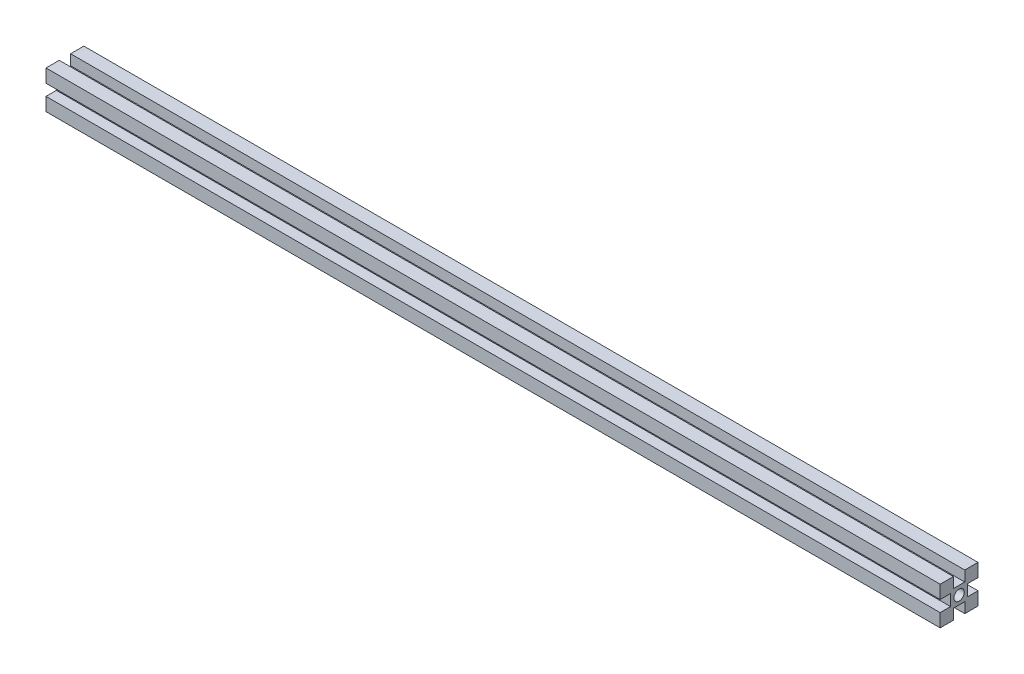
ISO-10303-21;
HEADER;
FILE_DESCRIPTION(('STEP AP214'),'2;1');
FILE_NAME('part.step','',(''),(''),'','','');
FILE_SCHEMA(('AUTOMOTIVE_DESIGN { 1 0 10303 214 1 1 1 1 }'));
ENDSEC;
DATA;
#1=APPLICATION_CONTEXT('core data for automotive mechanical design processes');
#2=APPLICATION_PROTOCOL_DEFINITION('international standard','automotive_design',2000,#1);
#3=PRODUCT_CONTEXT('',#1,'mechanical');
#4=PRODUCT('Part','Part','',(#3));
#5=PRODUCT_RELATED_PRODUCT_CATEGORY('part','',(#4));
#6=PRODUCT_DEFINITION_FORMATION('','',#4);
#7=PRODUCT_DEFINITION_CONTEXT('part definition',#1,'design');
#8=PRODUCT_DEFINITION('design','',#6,#7);
#9=PRODUCT_DEFINITION_SHAPE('','',#8);
#10=(LENGTH_UNIT() NAMED_UNIT(*) SI_UNIT(.MILLI.,.METRE.));
#11=(NAMED_UNIT(*) PLANE_ANGLE_UNIT() SI_UNIT($,.RADIAN.));
#12=(NAMED_UNIT(*) SI_UNIT($,.STERADIAN.) SOLID_ANGLE_UNIT());
#13=UNCERTAINTY_MEASURE_WITH_UNIT(LENGTH_MEASURE(1.E-05),#10,'distance_accuracy_value','');
#14=(GEOMETRIC_REPRESENTATION_CONTEXT(3) GLOBAL_UNCERTAINTY_ASSIGNED_CONTEXT((#13)) GLOBAL_UNIT_ASSIGNED_CONTEXT((#10,
#11,#12)) REPRESENTATION_CONTEXT('',''));
#15=CARTESIAN_POINT('',(0.,0.,0.));
#16=DIRECTION('',(0.,0.,1.));
#17=DIRECTION('',(1.,0.,0.));
#18=AXIS2_PLACEMENT_3D('',#15,#16,#17);
#19=CARTESIAN_POINT('',(472.5,10.,-9.99999999999997));
#20=DIRECTION('',(0.,0.,-1.));
#21=DIRECTION('',(-1.,0.,0.));
#22=AXIS2_PLACEMENT_3D('',#19,#20,#21);
#23=PLANE('',#22);
#24=DIRECTION('',(0.,-1.,0.));
#25=VECTOR('',#24,1.);
#26=CARTESIAN_POINT('',(0.,10.,-10.));
#27=LINE('',#26,#25);
#28=CARTESIAN_POINT('',(0.,10.,-10.));
#29=VERTEX_POINT('',#28);
#30=CARTESIAN_POINT('',(0.,3.,-10.));
#31=VERTEX_POINT('',#30);
#32=EDGE_CURVE('E214',#29,#31,#27,.T.);
#33=ORIENTED_EDGE('',*,*,#32,.F.);
#34=DIRECTION('',(-1.,0.,0.));
#35=VECTOR('',#34,1.);
#36=CARTESIAN_POINT('',(472.5,10.,-9.99999999999997));
#37=LINE('',#36,#35);
#38=CARTESIAN_POINT('',(472.5,10.,-9.99999999999997));
#39=VERTEX_POINT('',#38);
#40=EDGE_CURVE('E11',#39,#29,#37,.T.);
#41=ORIENTED_EDGE('',*,*,#40,.F.);
#42=DIRECTION('',(0.,-1.,0.));
#43=VECTOR('',#42,1.);
#44=CARTESIAN_POINT('',(472.5,10.,-9.99999999999997));
#45=LINE('',#44,#43);
#46=CARTESIAN_POINT('',(472.5,3.,-9.99999999999997));
#47=VERTEX_POINT('',#46);
#48=EDGE_CURVE('E291',#39,#47,#45,.T.);
#49=ORIENTED_EDGE('',*,*,#48,.T.);
#50=DIRECTION('',(-1.,0.,0.));
#51=VECTOR('',#50,1.);
#52=CARTESIAN_POINT('',(472.5,3.,-9.99999999999997));
#53=LINE('',#52,#51);
#54=EDGE_CURVE('E42',#47,#31,#53,.T.);
#55=ORIENTED_EDGE('',*,*,#54,.T.);
#56=EDGE_LOOP('',(#33,#41,#49,#55));
#57=FACE_BOUND('',#56,.T.);
#58=ADVANCED_FACE('F39',(#57),#23,.T.);
#59=CARTESIAN_POINT('',(472.5,10.,-2.99999999999997));
#60=DIRECTION('',(0.,1.,0.));
#61=DIRECTION('',(0.,0.,1.));
#62=AXIS2_PLACEMENT_3D('',#59,#60,#61);
#63=PLANE('',#62);
#64=DIRECTION('',(0.,0.,-1.));
#65=VECTOR('',#64,1.);
#66=CARTESIAN_POINT('',(0.,10.,-3.));
#67=LINE('',#66,#65);
#68=CARTESIAN_POINT('',(0.,10.,-3.));
#69=VERTEX_POINT('',#68);
#70=EDGE_CURVE('E288',#69,#29,#67,.T.);
#71=ORIENTED_EDGE('',*,*,#70,.F.);
#72=DIRECTION('',(-1.,0.,0.));
#73=VECTOR('',#72,1.);
#74=CARTESIAN_POINT('',(472.5,10.,-2.99999999999997));
#75=LINE('',#74,#73);
#76=CARTESIAN_POINT('',(472.5,10.,-2.99999999999997));
#77=VERTEX_POINT('',#76);
#78=EDGE_CURVE('E49',#77,#69,#75,.T.);
#79=ORIENTED_EDGE('',*,*,#78,.F.);
#80=DIRECTION('',(0.,0.,-1.));
#81=VECTOR('',#80,1.);
#82=CARTESIAN_POINT('',(472.5,10.,-2.99999999999997));
#83=LINE('',#82,#81);
#84=EDGE_CURVE('E200',#77,#39,#83,.T.);
#85=ORIENTED_EDGE('',*,*,#84,.T.);
#86=ORIENTED_EDGE('',*,*,#40,.T.);
#87=EDGE_LOOP('',(#71,#79,#85,#86));
#88=FACE_BOUND('',#87,.T.);
#89=ADVANCED_FACE('F345',(#88),#63,.T.);
#90=CARTESIAN_POINT('',(472.5,4.5,-2.99999999999997));
#91=DIRECTION('',(0.,0.,1.));
#92=DIRECTION('',(1.,0.,0.));
#93=AXIS2_PLACEMENT_3D('',#90,#91,#92);
#94=PLANE('',#93);
#95=DIRECTION('',(0.,1.,0.));
#96=VECTOR('',#95,1.);
#97=CARTESIAN_POINT('',(0.,4.5,-3.));
#98=LINE('',#97,#96);
#99=CARTESIAN_POINT('',(0.,4.5,-3.));
#100=VERTEX_POINT('',#99);
#101=EDGE_CURVE('E186',#100,#69,#98,.T.);
#102=ORIENTED_EDGE('',*,*,#101,.F.);
#103=DIRECTION('',(-1.,0.,0.));
#104=VECTOR('',#103,1.);
#105=CARTESIAN_POINT('',(472.5,4.5,-2.99999999999997));
#106=LINE('',#105,#104);
#107=CARTESIAN_POINT('',(472.5,4.5,-2.99999999999997));
#108=VERTEX_POINT('',#107);
#109=EDGE_CURVE('E181',#108,#100,#106,.T.);
#110=ORIENTED_EDGE('',*,*,#109,.F.);
#111=DIRECTION('',(0.,1.,0.));
#112=VECTOR('',#111,1.);
#113=CARTESIAN_POINT('',(472.5,4.5,-2.99999999999997));
#114=LINE('',#113,#112);
#115=EDGE_CURVE('E184',#108,#77,#114,.T.);
#116=ORIENTED_EDGE('',*,*,#115,.T.);
#117=ORIENTED_EDGE('',*,*,#78,.T.);
#118=EDGE_LOOP('',(#102,#110,#116,#117));
#119=FACE_BOUND('',#118,.T.);
#120=ADVANCED_FACE('F183',(#119),#94,.T.);
#121=CARTESIAN_POINT('',(472.5,4.5,3.00000000000003));
#122=DIRECTION('',(0.,1.,0.));
#123=DIRECTION('',(0.,0.,1.));
#124=AXIS2_PLACEMENT_3D('',#121,#122,#123);
#125=PLANE('',#124);
#126=DIRECTION('',(0.,0.,-1.));
#127=VECTOR('',#126,1.);
#128=CARTESIAN_POINT('',(0.,4.5,3.));
#129=LINE('',#128,#127);
#130=CARTESIAN_POINT('',(0.,4.5,3.));
#131=VERTEX_POINT('',#130);
#132=EDGE_CURVE('E283',#131,#100,#129,.T.);
#133=ORIENTED_EDGE('',*,*,#132,.F.);
#134=DIRECTION('',(-1.,0.,0.));
#135=VECTOR('',#134,1.);
#136=CARTESIAN_POINT('',(472.5,4.5,3.00000000000003));
#137=LINE('',#136,#135);
#138=CARTESIAN_POINT('',(472.5,4.5,3.00000000000003));
#139=VERTEX_POINT('',#138);
#140=EDGE_CURVE('E192',#139,#131,#137,.T.);
#141=ORIENTED_EDGE('',*,*,#140,.F.);
#142=DIRECTION('',(0.,0.,-1.));
#143=VECTOR('',#142,1.);
#144=CARTESIAN_POINT('',(472.5,4.5,3.00000000000003));
#145=LINE('',#144,#143);
#146=EDGE_CURVE('E198',#139,#108,#145,.T.);
#147=ORIENTED_EDGE('',*,*,#146,.T.);
#148=ORIENTED_EDGE('',*,*,#109,.T.);
#149=EDGE_LOOP('',(#133,#141,#147,#148));
#150=FACE_BOUND('',#149,.T.);
#151=ADVANCED_FACE('F203',(#150),#125,.T.);
#152=CARTESIAN_POINT('',(472.5,10.,3.00000000000003));
#153=DIRECTION('',(0.,0.,-1.));
#154=DIRECTION('',(-1.,0.,0.));
#155=AXIS2_PLACEMENT_3D('',#152,#153,#154);
#156=PLANE('',#155);
#157=DIRECTION('',(0.,-1.,0.));
#158=VECTOR('',#157,1.);
#159=CARTESIAN_POINT('',(0.,10.,3.));
#160=LINE('',#159,#158);
#161=CARTESIAN_POINT('',(0.,10.,3.));
#162=VERTEX_POINT('',#161);
#163=EDGE_CURVE('E279',#162,#131,#160,.T.);
#164=ORIENTED_EDGE('',*,*,#163,.F.);
#165=DIRECTION('',(-1.,0.,0.));
#166=VECTOR('',#165,1.);
#167=CARTESIAN_POINT('',(472.5,10.,3.00000000000003));
#168=LINE('',#167,#166);
#169=CARTESIAN_POINT('',(472.5,10.,3.00000000000003));
#170=VERTEX_POINT('',#169);
#171=EDGE_CURVE('E297',#170,#162,#168,.T.);
#172=ORIENTED_EDGE('',*,*,#171,.F.);
#173=DIRECTION('',(0.,-1.,0.));
#174=VECTOR('',#173,1.);
#175=CARTESIAN_POINT('',(472.5,10.,3.00000000000003));
#176=LINE('',#175,#174);
#177=EDGE_CURVE('E205',#170,#139,#176,.T.);
#178=ORIENTED_EDGE('',*,*,#177,.T.);
#179=ORIENTED_EDGE('',*,*,#140,.T.);
#180=EDGE_LOOP('',(#164,#172,#178,#179));
#181=FACE_BOUND('',#180,.T.);
#182=ADVANCED_FACE('F358',(#181),#156,.T.);
#183=CARTESIAN_POINT('',(472.5,10.,10.));
#184=DIRECTION('',(0.,1.,0.));
#185=DIRECTION('',(0.,0.,1.));
#186=AXIS2_PLACEMENT_3D('',#183,#184,#185);
#187=PLANE('',#186);
#188=DIRECTION('',(0.,0.,-1.));
#189=VECTOR('',#188,1.);
#190=CARTESIAN_POINT('',(0.,10.,10.));
#191=LINE('',#190,#189);
#192=CARTESIAN_POINT('',(0.,10.,10.));
#193=VERTEX_POINT('',#192);
#194=EDGE_CURVE('E275',#193,#162,#191,.T.);
#195=ORIENTED_EDGE('',*,*,#194,.F.);
#196=DIRECTION('',(-1.,0.,0.));
#197=VECTOR('',#196,1.);
#198=CARTESIAN_POINT('',(472.5,10.,10.));
#199=LINE('',#198,#197);
#200=CARTESIAN_POINT('',(472.5,10.,10.));
#201=VERTEX_POINT('',#200);
#202=EDGE_CURVE('E300',#201,#193,#199,.T.);
#203=ORIENTED_EDGE('',*,*,#202,.F.);
#204=DIRECTION('',(0.,0.,-1.));
#205=VECTOR('',#204,1.);
#206=CARTESIAN_POINT('',(472.5,10.,10.));
#207=LINE('',#206,#205);
#208=EDGE_CURVE('E208',#201,#170,#207,.T.);
#209=ORIENTED_EDGE('',*,*,#208,.T.);
#210=ORIENTED_EDGE('',*,*,#171,.T.);
#211=EDGE_LOOP('',(#195,#203,#209,#210));
#212=FACE_BOUND('',#211,.T.);
#213=ADVANCED_FACE('F361',(#212),#187,.T.);
#214=CARTESIAN_POINT('',(472.5,3.,10.));
#215=DIRECTION('',(0.,0.,1.));
#216=DIRECTION('',(1.,0.,0.));
#217=AXIS2_PLACEMENT_3D('',#214,#215,#216);
#218=PLANE('',#217);
#219=DIRECTION('',(0.,1.,0.));
#220=VECTOR('',#219,1.);
#221=CARTESIAN_POINT('',(0.,3.,10.));
#222=LINE('',#221,#220);
#223=CARTESIAN_POINT('',(0.,3.,10.));
#224=VERTEX_POINT('',#223);
#225=EDGE_CURVE('E271',#224,#193,#222,.T.);
#226=ORIENTED_EDGE('',*,*,#225,.F.);
#227=DIRECTION('',(-1.,0.,0.));
#228=VECTOR('',#227,1.);
#229=CARTESIAN_POINT('',(472.5,3.,10.));
#230=LINE('',#229,#228);
#231=CARTESIAN_POINT('',(472.5,3.,10.));
#232=VERTEX_POINT('',#231);
#233=EDGE_CURVE('E303',#232,#224,#230,.T.);
#234=ORIENTED_EDGE('',*,*,#233,.F.);
#235=DIRECTION('',(0.,1.,0.));
#236=VECTOR('',#235,1.);
#237=CARTESIAN_POINT('',(472.5,3.,10.));
#238=LINE('',#237,#236);
#239=EDGE_CURVE('E496',#232,#201,#238,.T.);
#240=ORIENTED_EDGE('',*,*,#239,.T.);
#241=ORIENTED_EDGE('',*,*,#202,.T.);
#242=EDGE_LOOP('',(#226,#234,#240,#241));
#243=FACE_BOUND('',#242,.T.);
#244=ADVANCED_FACE('F365',(#243),#218,.T.);
#245=CARTESIAN_POINT('',(472.5,3.,4.50000000000003));
#246=DIRECTION('',(0.,-1.,0.));
#247=DIRECTION('',(0.,0.,-1.));
#248=AXIS2_PLACEMENT_3D('',#245,#246,#247);
#249=PLANE('',#248);
#250=DIRECTION('',(0.,0.,1.));
#251=VECTOR('',#250,1.);
#252=CARTESIAN_POINT('',(0.,3.,4.5));
#253=LINE('',#252,#251);
#254=CARTESIAN_POINT('',(0.,3.,4.5));
#255=VERTEX_POINT('',#254);
#256=EDGE_CURVE('E267',#255,#224,#253,.T.);
#257=ORIENTED_EDGE('',*,*,#256,.F.);
#258=DIRECTION('',(-1.,0.,0.));
#259=VECTOR('',#258,1.);
#260=CARTESIAN_POINT('',(472.5,3.,4.50000000000003));
#261=LINE('',#260,#259);
#262=CARTESIAN_POINT('',(472.5,3.,4.50000000000003));
#263=VERTEX_POINT('',#262);
#264=EDGE_CURVE('E306',#263,#255,#261,.T.);
#265=ORIENTED_EDGE('',*,*,#264,.F.);
#266=DIRECTION('',(0.,0.,1.));
#267=VECTOR('',#266,1.);
#268=CARTESIAN_POINT('',(472.5,3.,4.50000000000003));
#269=LINE('',#268,#267);
#270=EDGE_CURVE('E492',#263,#232,#269,.T.);
#271=ORIENTED_EDGE('',*,*,#270,.T.);
#272=ORIENTED_EDGE('',*,*,#233,.T.);
#273=EDGE_LOOP('',(#257,#265,#271,#272));
#274=FACE_BOUND('',#273,.T.);
#275=ADVANCED_FACE('F369',(#274),#249,.T.);
#276=CARTESIAN_POINT('',(472.5,-3.,4.50000000000003));
#277=DIRECTION('',(0.,0.,1.));
#278=DIRECTION('',(1.,0.,0.));
#279=AXIS2_PLACEMENT_3D('',#276,#277,#278);
#280=PLANE('',#279);
#281=DIRECTION('',(0.,1.,0.));
#282=VECTOR('',#281,1.);
#283=CARTESIAN_POINT('',(0.,-3.,4.5));
#284=LINE('',#283,#282);
#285=CARTESIAN_POINT('',(0.,-3.,4.5));
#286=VERTEX_POINT('',#285);
#287=EDGE_CURVE('E263',#286,#255,#284,.T.);
#288=ORIENTED_EDGE('',*,*,#287,.F.);
#289=DIRECTION('',(-1.,0.,0.));
#290=VECTOR('',#289,1.);
#291=CARTESIAN_POINT('',(472.5,-3.,4.50000000000003));
#292=LINE('',#291,#290);
#293=CARTESIAN_POINT('',(472.5,-3.,4.50000000000003));
#294=VERTEX_POINT('',#293);
#295=EDGE_CURVE('E309',#294,#286,#292,.T.);
#296=ORIENTED_EDGE('',*,*,#295,.F.);
#297=DIRECTION('',(0.,1.,0.));
#298=VECTOR('',#297,1.);
#299=CARTESIAN_POINT('',(472.5,-3.,4.50000000000003));
#300=LINE('',#299,#298);
#301=EDGE_CURVE('E488',#294,#263,#300,.T.);
#302=ORIENTED_EDGE('',*,*,#301,.T.);
#303=ORIENTED_EDGE('',*,*,#264,.T.);
#304=EDGE_LOOP('',(#288,#296,#302,#303));
#305=FACE_BOUND('',#304,.T.);
#306=ADVANCED_FACE('F373',(#305),#280,.T.);
#307=CARTESIAN_POINT('',(472.5,-3.,10.));
#308=DIRECTION('',(0.,1.,0.));
#309=DIRECTION('',(0.,0.,1.));
#310=AXIS2_PLACEMENT_3D('',#307,#308,#309);
#311=PLANE('',#310);
#312=DIRECTION('',(0.,0.,-1.));
#313=VECTOR('',#312,1.);
#314=CARTESIAN_POINT('',(0.,-3.,10.));
#315=LINE('',#314,#313);
#316=CARTESIAN_POINT('',(0.,-3.,10.));
#317=VERTEX_POINT('',#316);
#318=EDGE_CURVE('E259',#317,#286,#315,.T.);
#319=ORIENTED_EDGE('',*,*,#318,.F.);
#320=DIRECTION('',(-1.,0.,0.));
#321=VECTOR('',#320,1.);
#322=CARTESIAN_POINT('',(472.5,-3.,10.));
#323=LINE('',#322,#321);
#324=CARTESIAN_POINT('',(472.5,-3.,10.));
#325=VERTEX_POINT('',#324);
#326=EDGE_CURVE('E312',#325,#317,#323,.T.);
#327=ORIENTED_EDGE('',*,*,#326,.F.);
#328=DIRECTION('',(0.,0.,-1.));
#329=VECTOR('',#328,1.);
#330=CARTESIAN_POINT('',(472.5,-3.,10.));
#331=LINE('',#330,#329);
#332=EDGE_CURVE('E484',#325,#294,#331,.T.);
#333=ORIENTED_EDGE('',*,*,#332,.T.);
#334=ORIENTED_EDGE('',*,*,#295,.T.);
#335=EDGE_LOOP('',(#319,#327,#333,#334));
#336=FACE_BOUND('',#335,.T.);
#337=ADVANCED_FACE('F377',(#336),#311,.T.);
#338=CARTESIAN_POINT('',(472.5,-10.,10.));
#339=DIRECTION('',(0.,0.,1.));
#340=DIRECTION('',(1.,0.,0.));
#341=AXIS2_PLACEMENT_3D('',#338,#339,#340);
#342=PLANE('',#341);
#343=DIRECTION('',(0.,1.,0.));
#344=VECTOR('',#343,1.);
#345=CARTESIAN_POINT('',(0.,-10.,10.));
#346=LINE('',#345,#344);
#347=CARTESIAN_POINT('',(0.,-10.,10.));
#348=VERTEX_POINT('',#347);
#349=EDGE_CURVE('E255',#348,#317,#346,.T.);
#350=ORIENTED_EDGE('',*,*,#349,.F.);
#351=DIRECTION('',(-1.,0.,0.));
#352=VECTOR('',#351,1.);
#353=CARTESIAN_POINT('',(472.5,-10.,10.));
#354=LINE('',#353,#352);
#355=CARTESIAN_POINT('',(472.5,-10.,10.));
#356=VERTEX_POINT('',#355);
#357=EDGE_CURVE('E315',#356,#348,#354,.T.);
#358=ORIENTED_EDGE('',*,*,#357,.F.);
#359=DIRECTION('',(0.,1.,0.));
#360=VECTOR('',#359,1.);
#361=CARTESIAN_POINT('',(472.5,-10.,10.));
#362=LINE('',#361,#360);
#363=EDGE_CURVE('E480',#356,#325,#362,.T.);
#364=ORIENTED_EDGE('',*,*,#363,.T.);
#365=ORIENTED_EDGE('',*,*,#326,.T.);
#366=EDGE_LOOP('',(#350,#358,#364,#365));
#367=FACE_BOUND('',#366,.T.);
#368=ADVANCED_FACE('F381',(#367),#342,.T.);
#369=CARTESIAN_POINT('',(472.5,-10.,3.00000000000003));
#370=DIRECTION('',(0.,-1.,0.));
#371=DIRECTION('',(0.,0.,-1.));
#372=AXIS2_PLACEMENT_3D('',#369,#370,#371);
#373=PLANE('',#372);
#374=DIRECTION('',(0.,0.,1.));
#375=VECTOR('',#374,1.);
#376=CARTESIAN_POINT('',(0.,-10.,3.));
#377=LINE('',#376,#375);
#378=CARTESIAN_POINT('',(0.,-10.,3.));
#379=VERTEX_POINT('',#378);
#380=EDGE_CURVE('E251',#379,#348,#377,.T.);
#381=ORIENTED_EDGE('',*,*,#380,.F.);
#382=DIRECTION('',(-1.,0.,0.));
#383=VECTOR('',#382,1.);
#384=CARTESIAN_POINT('',(472.5,-10.,3.00000000000003));
#385=LINE('',#384,#383);
#386=CARTESIAN_POINT('',(472.5,-10.,3.00000000000003));
#387=VERTEX_POINT('',#386);
#388=EDGE_CURVE('E318',#387,#379,#385,.T.);
#389=ORIENTED_EDGE('',*,*,#388,.F.);
#390=DIRECTION('',(0.,0.,1.));
#391=VECTOR('',#390,1.);
#392=CARTESIAN_POINT('',(472.5,-10.,3.00000000000003));
#393=LINE('',#392,#391);
#394=EDGE_CURVE('E476',#387,#356,#393,.T.);
#395=ORIENTED_EDGE('',*,*,#394,.T.);
#396=ORIENTED_EDGE('',*,*,#357,.T.);
#397=EDGE_LOOP('',(#381,#389,#395,#396));
#398=FACE_BOUND('',#397,.T.);
#399=ADVANCED_FACE('F385',(#398),#373,.T.);
#400=CARTESIAN_POINT('',(472.5,-4.5,3.00000000000003));
#401=DIRECTION('',(0.,0.,-1.));
#402=DIRECTION('',(-1.,0.,0.));
#403=AXIS2_PLACEMENT_3D('',#400,#401,#402);
#404=PLANE('',#403);
#405=DIRECTION('',(0.,-1.,0.));
#406=VECTOR('',#405,1.);
#407=CARTESIAN_POINT('',(0.,-4.5,3.));
#408=LINE('',#407,#406);
#409=CARTESIAN_POINT('',(0.,-4.5,3.));
#410=VERTEX_POINT('',#409);
#411=EDGE_CURVE('E247',#410,#379,#408,.T.);
#412=ORIENTED_EDGE('',*,*,#411,.F.);
#413=DIRECTION('',(-1.,0.,0.));
#414=VECTOR('',#413,1.);
#415=CARTESIAN_POINT('',(472.5,-4.5,3.00000000000003));
#416=LINE('',#415,#414);
#417=CARTESIAN_POINT('',(472.5,-4.5,3.00000000000003));
#418=VERTEX_POINT('',#417);
#419=EDGE_CURVE('E321',#418,#410,#416,.T.);
#420=ORIENTED_EDGE('',*,*,#419,.F.);
#421=DIRECTION('',(0.,-1.,0.));
#422=VECTOR('',#421,1.);
#423=CARTESIAN_POINT('',(472.5,-4.5,3.00000000000003));
#424=LINE('',#423,#422);
#425=EDGE_CURVE('E472',#418,#387,#424,.T.);
#426=ORIENTED_EDGE('',*,*,#425,.T.);
#427=ORIENTED_EDGE('',*,*,#388,.T.);
#428=EDGE_LOOP('',(#412,#420,#426,#427));
#429=FACE_BOUND('',#428,.T.);
#430=ADVANCED_FACE('F389',(#429),#404,.T.);
#431=CARTESIAN_POINT('',(472.5,-4.5,-2.99999999999997));
#432=DIRECTION('',(0.,-1.,0.));
#433=DIRECTION('',(0.,0.,-1.));
#434=AXIS2_PLACEMENT_3D('',#431,#432,#433);
#435=PLANE('',#434);
#436=DIRECTION('',(0.,0.,1.));
#437=VECTOR('',#436,1.);
#438=CARTESIAN_POINT('',(0.,-4.5,-3.));
#439=LINE('',#438,#437);
#440=CARTESIAN_POINT('',(0.,-4.5,-3.));
#441=VERTEX_POINT('',#440);
#442=EDGE_CURVE('E243',#441,#410,#439,.T.);
#443=ORIENTED_EDGE('',*,*,#442,.F.);
#444=DIRECTION('',(-1.,0.,0.));
#445=VECTOR('',#444,1.);
#446=CARTESIAN_POINT('',(472.5,-4.5,-2.99999999999997));
#447=LINE('',#446,#445);
#448=CARTESIAN_POINT('',(472.5,-4.5,-2.99999999999997));
#449=VERTEX_POINT('',#448);
#450=EDGE_CURVE('E324',#449,#441,#447,.T.);
#451=ORIENTED_EDGE('',*,*,#450,.F.);
#452=DIRECTION('',(0.,0.,1.));
#453=VECTOR('',#452,1.);
#454=CARTESIAN_POINT('',(472.5,-4.5,-2.99999999999997));
#455=LINE('',#454,#453);
#456=EDGE_CURVE('E468',#449,#418,#455,.T.);
#457=ORIENTED_EDGE('',*,*,#456,.T.);
#458=ORIENTED_EDGE('',*,*,#419,.T.);
#459=EDGE_LOOP('',(#443,#451,#457,#458));
#460=FACE_BOUND('',#459,.T.);
#461=ADVANCED_FACE('F393',(#460),#435,.T.);
#462=CARTESIAN_POINT('',(472.5,-10.,-2.99999999999997));
#463=DIRECTION('',(0.,0.,1.));
#464=DIRECTION('',(1.,0.,0.));
#465=AXIS2_PLACEMENT_3D('',#462,#463,#464);
#466=PLANE('',#465);
#467=DIRECTION('',(0.,1.,0.));
#468=VECTOR('',#467,1.);
#469=CARTESIAN_POINT('',(0.,-10.,-3.));
#470=LINE('',#469,#468);
#471=CARTESIAN_POINT('',(0.,-10.,-3.));
#472=VERTEX_POINT('',#471);
#473=EDGE_CURVE('E239',#472,#441,#470,.T.);
#474=ORIENTED_EDGE('',*,*,#473,.F.);
#475=DIRECTION('',(-1.,0.,0.));
#476=VECTOR('',#475,1.);
#477=CARTESIAN_POINT('',(472.5,-10.,-2.99999999999997));
#478=LINE('',#477,#476);
#479=CARTESIAN_POINT('',(472.5,-10.,-2.99999999999997));
#480=VERTEX_POINT('',#479);
#481=EDGE_CURVE('E327',#480,#472,#478,.T.);
#482=ORIENTED_EDGE('',*,*,#481,.F.);
#483=DIRECTION('',(0.,1.,0.));
#484=VECTOR('',#483,1.);
#485=CARTESIAN_POINT('',(472.5,-10.,-2.99999999999997));
#486=LINE('',#485,#484);
#487=EDGE_CURVE('E464',#480,#449,#486,.T.);
#488=ORIENTED_EDGE('',*,*,#487,.T.);
#489=ORIENTED_EDGE('',*,*,#450,.T.);
#490=EDGE_LOOP('',(#474,#482,#488,#489));
#491=FACE_BOUND('',#490,.T.);
#492=ADVANCED_FACE('F397',(#491),#466,.T.);
#493=CARTESIAN_POINT('',(472.5,-10.,-9.99999999999997));
#494=DIRECTION('',(0.,-1.,0.));
#495=DIRECTION('',(0.,0.,-1.));
#496=AXIS2_PLACEMENT_3D('',#493,#494,#495);
#497=PLANE('',#496);
#498=DIRECTION('',(0.,0.,1.));
#499=VECTOR('',#498,1.);
#500=CARTESIAN_POINT('',(0.,-10.,-10.));
#501=LINE('',#500,#499);
#502=CARTESIAN_POINT('',(0.,-10.,-10.));
#503=VERTEX_POINT('',#502);
#504=EDGE_CURVE('E235',#503,#472,#501,.T.);
#505=ORIENTED_EDGE('',*,*,#504,.F.);
#506=DIRECTION('',(-1.,0.,0.));
#507=VECTOR('',#506,1.);
#508=CARTESIAN_POINT('',(472.5,-10.,-9.99999999999997));
#509=LINE('',#508,#507);
#510=CARTESIAN_POINT('',(472.5,-10.,-9.99999999999997));
#511=VERTEX_POINT('',#510);
#512=EDGE_CURVE('E330',#511,#503,#509,.T.);
#513=ORIENTED_EDGE('',*,*,#512,.F.);
#514=DIRECTION('',(0.,0.,1.));
#515=VECTOR('',#514,1.);
#516=CARTESIAN_POINT('',(472.5,-10.,-9.99999999999997));
#517=LINE('',#516,#515);
#518=EDGE_CURVE('E460',#511,#480,#517,.T.);
#519=ORIENTED_EDGE('',*,*,#518,.T.);
#520=ORIENTED_EDGE('',*,*,#481,.T.);
#521=EDGE_LOOP('',(#505,#513,#519,#520));
#522=FACE_BOUND('',#521,.T.);
#523=ADVANCED_FACE('F401',(#522),#497,.T.);
#524=CARTESIAN_POINT('',(472.5,-3.,-9.99999999999997));
#525=DIRECTION('',(0.,0.,-1.));
#526=DIRECTION('',(-1.,0.,0.));
#527=AXIS2_PLACEMENT_3D('',#524,#525,#526);
#528=PLANE('',#527);
#529=DIRECTION('',(0.,-1.,0.));
#530=VECTOR('',#529,1.);
#531=CARTESIAN_POINT('',(0.,-3.,-10.));
#532=LINE('',#531,#530);
#533=CARTESIAN_POINT('',(0.,-3.,-10.));
#534=VERTEX_POINT('',#533);
#535=EDGE_CURVE('E231',#534,#503,#532,.T.);
#536=ORIENTED_EDGE('',*,*,#535,.F.);
#537=DIRECTION('',(-1.,0.,0.));
#538=VECTOR('',#537,1.);
#539=CARTESIAN_POINT('',(472.5,-3.,-9.99999999999997));
#540=LINE('',#539,#538);
#541=CARTESIAN_POINT('',(472.5,-3.,-9.99999999999997));
#542=VERTEX_POINT('',#541);
#543=EDGE_CURVE('E333',#542,#534,#540,.T.);
#544=ORIENTED_EDGE('',*,*,#543,.F.);
#545=DIRECTION('',(0.,-1.,0.));
#546=VECTOR('',#545,1.);
#547=CARTESIAN_POINT('',(472.5,-3.,-9.99999999999997));
#548=LINE('',#547,#546);
#549=EDGE_CURVE('E456',#542,#511,#548,.T.);
#550=ORIENTED_EDGE('',*,*,#549,.T.);
#551=ORIENTED_EDGE('',*,*,#512,.T.);
#552=EDGE_LOOP('',(#536,#544,#550,#551));
#553=FACE_BOUND('',#552,.T.);
#554=ADVANCED_FACE('F405',(#553),#528,.T.);
#555=CARTESIAN_POINT('',(472.5,-3.,-4.49999999999997));
#556=DIRECTION('',(0.,1.,0.));
#557=DIRECTION('',(0.,0.,1.));
#558=AXIS2_PLACEMENT_3D('',#555,#556,#557);
#559=PLANE('',#558);
#560=DIRECTION('',(0.,0.,-1.));
#561=VECTOR('',#560,1.);
#562=CARTESIAN_POINT('',(0.,-3.,-4.5));
#563=LINE('',#562,#561);
#564=CARTESIAN_POINT('',(0.,-3.,-4.5));
#565=VERTEX_POINT('',#564);
#566=EDGE_CURVE('E227',#565,#534,#563,.T.);
#567=ORIENTED_EDGE('',*,*,#566,.F.);
#568=DIRECTION('',(-1.,0.,0.));
#569=VECTOR('',#568,1.);
#570=CARTESIAN_POINT('',(472.5,-3.,-4.49999999999997));
#571=LINE('',#570,#569);
#572=CARTESIAN_POINT('',(472.5,-3.,-4.49999999999997));
#573=VERTEX_POINT('',#572);
#574=EDGE_CURVE('E336',#573,#565,#571,.T.);
#575=ORIENTED_EDGE('',*,*,#574,.F.);
#576=DIRECTION('',(0.,0.,-1.));
#577=VECTOR('',#576,1.);
#578=CARTESIAN_POINT('',(472.5,-3.,-4.49999999999997));
#579=LINE('',#578,#577);
#580=EDGE_CURVE('E452',#573,#542,#579,.T.);
#581=ORIENTED_EDGE('',*,*,#580,.T.);
#582=ORIENTED_EDGE('',*,*,#543,.T.);
#583=EDGE_LOOP('',(#567,#575,#581,#582));
#584=FACE_BOUND('',#583,.T.);
#585=ADVANCED_FACE('F409',(#584),#559,.T.);
#586=CARTESIAN_POINT('',(472.5,3.,-4.49999999999997));
#587=DIRECTION('',(0.,0.,-1.));
#588=DIRECTION('',(-1.,0.,0.));
#589=AXIS2_PLACEMENT_3D('',#586,#587,#588);
#590=PLANE('',#589);
#591=DIRECTION('',(0.,-1.,0.));
#592=VECTOR('',#591,1.);
#593=CARTESIAN_POINT('',(0.,3.,-4.5));
#594=LINE('',#593,#592);
#595=CARTESIAN_POINT('',(0.,3.,-4.5));
#596=VERTEX_POINT('',#595);
#597=EDGE_CURVE('E223',#596,#565,#594,.T.);
#598=ORIENTED_EDGE('',*,*,#597,.F.);
#599=DIRECTION('',(-1.,0.,0.));
#600=VECTOR('',#599,1.);
#601=CARTESIAN_POINT('',(472.5,3.,-4.49999999999997));
#602=LINE('',#601,#600);
#603=CARTESIAN_POINT('',(472.5,3.,-4.49999999999997));
#604=VERTEX_POINT('',#603);
#605=EDGE_CURVE('E338',#604,#596,#602,.T.);
#606=ORIENTED_EDGE('',*,*,#605,.F.);
#607=DIRECTION('',(0.,-1.,0.));
#608=VECTOR('',#607,1.);
#609=CARTESIAN_POINT('',(472.5,3.,-4.49999999999997));
#610=LINE('',#609,#608);
#611=EDGE_CURVE('E448',#604,#573,#610,.T.);
#612=ORIENTED_EDGE('',*,*,#611,.T.);
#613=ORIENTED_EDGE('',*,*,#574,.T.);
#614=EDGE_LOOP('',(#598,#606,#612,#613));
#615=FACE_BOUND('',#614,.T.);
#616=ADVANCED_FACE('F413',(#615),#590,.T.);
#617=CARTESIAN_POINT('',(472.5,3.,-9.99999999999997));
#618=DIRECTION('',(0.,-1.,0.));
#619=DIRECTION('',(0.,0.,-1.));
#620=AXIS2_PLACEMENT_3D('',#617,#618,#619);
#621=PLANE('',#620);
#622=DIRECTION('',(0.,0.,1.));
#623=VECTOR('',#622,1.);
#624=CARTESIAN_POINT('',(0.,3.,-10.));
#625=LINE('',#624,#623);
#626=EDGE_CURVE('E218',#31,#596,#625,.T.);
#627=ORIENTED_EDGE('',*,*,#626,.F.);
#628=ORIENTED_EDGE('',*,*,#54,.F.);
#629=DIRECTION('',(0.,0.,1.));
#630=VECTOR('',#629,1.);
#631=CARTESIAN_POINT('',(472.5,3.,-9.99999999999997));
#632=LINE('',#631,#630);
#633=EDGE_CURVE('E445',#47,#604,#632,.T.);
#634=ORIENTED_EDGE('',*,*,#633,.T.);
#635=ORIENTED_EDGE('',*,*,#605,.T.);
#636=EDGE_LOOP('',(#627,#628,#634,#635));
#637=FACE_BOUND('',#636,.T.);
#638=ADVANCED_FACE('F342',(#637),#621,.T.);
#639=CARTESIAN_POINT('',(472.5,0.,0.));
#640=DIRECTION('',(-1.,0.,0.));
#641=DIRECTION('',(0.,0.,1.));
#642=AXIS2_PLACEMENT_3D('',#639,#640,#641);
#643=PLANE('',#642);
#644=CARTESIAN_POINT('',(472.5,0.,0.));
#645=DIRECTION('',(-1.,0.,0.));
#646=DIRECTION('',(0.,0.,-1.));
#647=AXIS2_PLACEMENT_3D('',#644,#645,#646);
#648=CIRCLE('',#647,2.75);
#649=CARTESIAN_POINT('',(472.5,0.,-2.74999999999997));
#650=VERTEX_POINT('',#649);
#651=EDGE_CURVE('E219',#650,#650,#648,.T.);
#652=ORIENTED_EDGE('',*,*,#651,.T.);
#653=EDGE_LOOP('',(#652));
#654=FACE_BOUND('',#653,.T.);
#655=ORIENTED_EDGE('',*,*,#48,.F.);
#656=ORIENTED_EDGE('',*,*,#84,.F.);
#657=ORIENTED_EDGE('',*,*,#115,.F.);
#658=ORIENTED_EDGE('',*,*,#146,.F.);
#659=ORIENTED_EDGE('',*,*,#177,.F.);
#660=ORIENTED_EDGE('',*,*,#208,.F.);
#661=ORIENTED_EDGE('',*,*,#239,.F.);
#662=ORIENTED_EDGE('',*,*,#270,.F.);
#663=ORIENTED_EDGE('',*,*,#301,.F.);
#664=ORIENTED_EDGE('',*,*,#332,.F.);
#665=ORIENTED_EDGE('',*,*,#363,.F.);
#666=ORIENTED_EDGE('',*,*,#394,.F.);
#667=ORIENTED_EDGE('',*,*,#425,.F.);
#668=ORIENTED_EDGE('',*,*,#456,.F.);
#669=ORIENTED_EDGE('',*,*,#487,.F.);
#670=ORIENTED_EDGE('',*,*,#518,.F.);
#671=ORIENTED_EDGE('',*,*,#549,.F.);
#672=ORIENTED_EDGE('',*,*,#580,.F.);
#673=ORIENTED_EDGE('',*,*,#611,.F.);
#674=ORIENTED_EDGE('',*,*,#633,.F.);
#675=EDGE_LOOP('',(#655,#656,#657,#658,#659,#660,#661,#662,#663,#664,#665,#666,#667,#668,#669,
#670,#671,#672,#673,#674));
#676=FACE_BOUND('',#675,.T.);
#677=ADVANCED_FACE('F196',(#654,#676),#643,.F.);
#678=CARTESIAN_POINT('',(0.,0.,0.));
#679=DIRECTION('',(-1.,0.,0.));
#680=DIRECTION('',(0.,0.,1.));
#681=AXIS2_PLACEMENT_3D('',#678,#679,#680);
#682=PLANE('',#681);
#683=CARTESIAN_POINT('',(0.,0.,0.));
#684=DIRECTION('',(-1.,0.,0.));
#685=DIRECTION('',(0.,0.,-1.));
#686=AXIS2_PLACEMENT_3D('',#683,#684,#685);
#687=CIRCLE('',#686,2.75);
#688=CARTESIAN_POINT('',(0.,0.,-2.75));
#689=VERTEX_POINT('',#688);
#690=EDGE_CURVE('E437',#689,#689,#687,.T.);
#691=ORIENTED_EDGE('',*,*,#690,.F.);
#692=EDGE_LOOP('',(#691));
#693=FACE_BOUND('',#692,.T.);
#694=ORIENTED_EDGE('',*,*,#32,.T.);
#695=ORIENTED_EDGE('',*,*,#626,.T.);
#696=ORIENTED_EDGE('',*,*,#597,.T.);
#697=ORIENTED_EDGE('',*,*,#566,.T.);
#698=ORIENTED_EDGE('',*,*,#535,.T.);
#699=ORIENTED_EDGE('',*,*,#504,.T.);
#700=ORIENTED_EDGE('',*,*,#473,.T.);
#701=ORIENTED_EDGE('',*,*,#442,.T.);
#702=ORIENTED_EDGE('',*,*,#411,.T.);
#703=ORIENTED_EDGE('',*,*,#380,.T.);
#704=ORIENTED_EDGE('',*,*,#349,.T.);
#705=ORIENTED_EDGE('',*,*,#318,.T.);
#706=ORIENTED_EDGE('',*,*,#287,.T.);
#707=ORIENTED_EDGE('',*,*,#256,.T.);
#708=ORIENTED_EDGE('',*,*,#225,.T.);
#709=ORIENTED_EDGE('',*,*,#194,.T.);
#710=ORIENTED_EDGE('',*,*,#163,.T.);
#711=ORIENTED_EDGE('',*,*,#132,.T.);
#712=ORIENTED_EDGE('',*,*,#101,.T.);
#713=ORIENTED_EDGE('',*,*,#70,.T.);
#714=EDGE_LOOP('',(#694,#695,#696,#697,#698,#699,#700,#701,#702,#703,#704,#705,#706,#707,#708,
#709,#710,#711,#712,#713));
#715=FACE_BOUND('',#714,.T.);
#716=ADVANCED_FACE('F344',(#693,#715),#682,.T.);
#717=CARTESIAN_POINT('',(472.5,0.,0.));
#718=DIRECTION('',(-1.,0.,0.));
#719=DIRECTION('',(0.,0.,1.));
#720=AXIS2_PLACEMENT_3D('',#717,#718,#719);
#721=CYLINDRICAL_SURFACE('',#720,2.75);
#722=ORIENTED_EDGE('',*,*,#651,.F.);
#723=EDGE_LOOP('',(#722));
#724=FACE_BOUND('',#723,.T.);
#725=ORIENTED_EDGE('',*,*,#690,.T.);
#726=EDGE_LOOP('',(#725));
#727=FACE_BOUND('',#726,.T.);
#728=ADVANCED_FACE('F425',(#724,#727),#721,.F.);
#729=CLOSED_SHELL('',(#58,#89,#120,#151,#182,#213,#244,#275,#306,#337,#368,#399,#430,#461,#492,
#523,#554,#585,#616,#638,#677,#716,#728));
#730=MANIFOLD_SOLID_BREP('B2',#729);
#731=ADVANCED_BREP_SHAPE_REPRESENTATION('',(#18,#730),#14);
#732=SHAPE_DEFINITION_REPRESENTATION(#9,#731);
ENDSEC;
END-ISO-10303-21;
